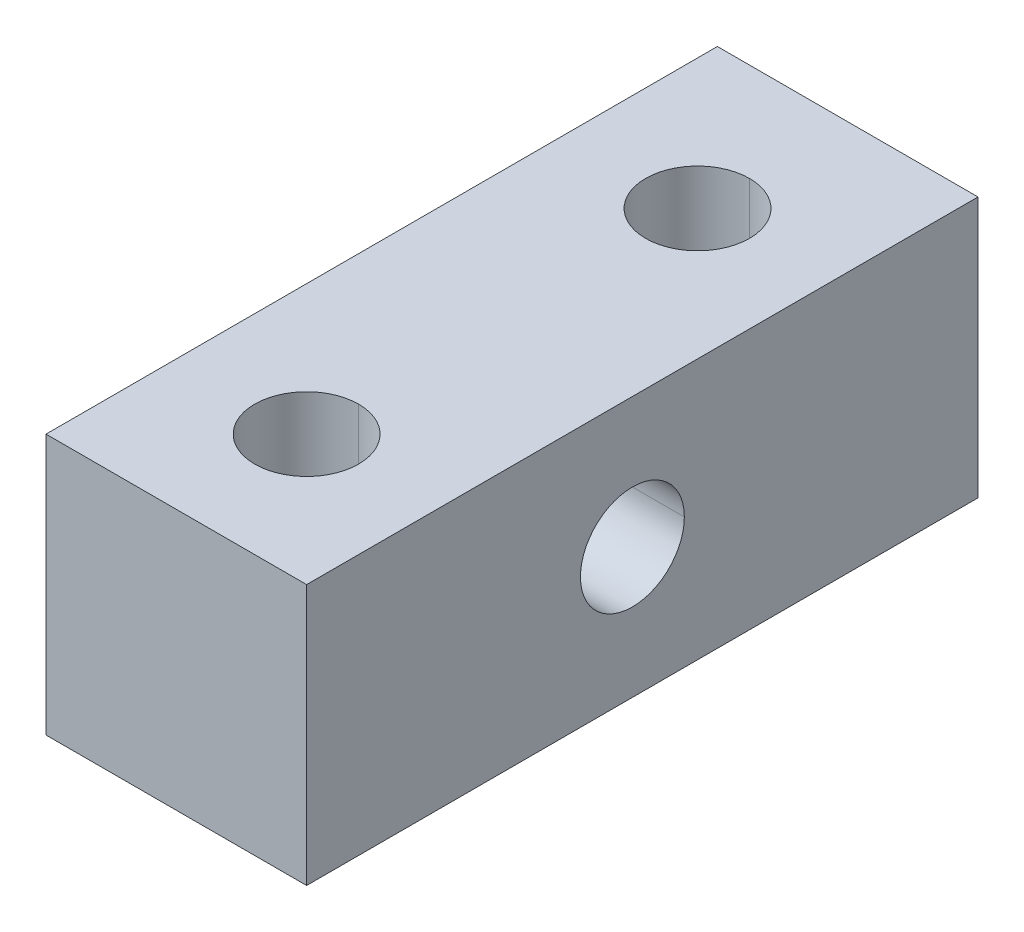
ISO-10303-21;
HEADER;
FILE_DESCRIPTION(('STEP AP214'),'2;1');
FILE_NAME('part.step','',(''),(''),'','','');
FILE_SCHEMA(('AUTOMOTIVE_DESIGN { 1 0 10303 214 1 1 1 1 }'));
ENDSEC;
DATA;
#1=APPLICATION_CONTEXT('core data for automotive mechanical design processes');
#2=APPLICATION_PROTOCOL_DEFINITION('international standard','automotive_design',2000,#1);
#3=PRODUCT_CONTEXT('',#1,'mechanical');
#4=PRODUCT('Part','Part','',(#3));
#5=PRODUCT_RELATED_PRODUCT_CATEGORY('part','',(#4));
#6=PRODUCT_DEFINITION_FORMATION('','',#4);
#7=PRODUCT_DEFINITION_CONTEXT('part definition',#1,'design');
#8=PRODUCT_DEFINITION('design','',#6,#7);
#9=PRODUCT_DEFINITION_SHAPE('','',#8);
#10=(LENGTH_UNIT() NAMED_UNIT(*) SI_UNIT(.MILLI.,.METRE.));
#11=(NAMED_UNIT(*) PLANE_ANGLE_UNIT() SI_UNIT($,.RADIAN.));
#12=(NAMED_UNIT(*) SI_UNIT($,.STERADIAN.) SOLID_ANGLE_UNIT());
#13=UNCERTAINTY_MEASURE_WITH_UNIT(LENGTH_MEASURE(1.E-05),#10,'distance_accuracy_value','');
#14=(GEOMETRIC_REPRESENTATION_CONTEXT(3) GLOBAL_UNCERTAINTY_ASSIGNED_CONTEXT((#13)) GLOBAL_UNIT_ASSIGNED_CONTEXT((#10,
#11,#12)) REPRESENTATION_CONTEXT('',''));
#15=CARTESIAN_POINT('',(0.,0.,0.));
#16=DIRECTION('',(0.,0.,1.));
#17=DIRECTION('',(1.,0.,0.));
#18=AXIS2_PLACEMENT_3D('',#15,#16,#17);
#19=CARTESIAN_POINT('',(4.7625,0.,-11.90625));
#20=DIRECTION('',(1.,0.,0.));
#21=DIRECTION('',(0.,0.,-1.));
#22=AXIS2_PLACEMENT_3D('',#19,#20,#21);
#23=CYLINDRICAL_SURFACE('',#22,1.89865);
#24=DIRECTION('',(1.,0.,0.));
#25=VECTOR('',#24,1.);
#26=CARTESIAN_POINT('',(4.7625,0.,-10.0076));
#27=LINE('',#26,#25);
#28=CARTESIAN_POINT('',(-4.7625,0.,-10.0076));
#29=VERTEX_POINT('',#28);
#30=CARTESIAN_POINT('',(4.7625,0.,-10.0076));
#31=VERTEX_POINT('',#30);
#32=EDGE_CURVE('E132',#29,#31,#27,.T.);
#33=ORIENTED_EDGE('',*,*,#32,.F.);
#34=CARTESIAN_POINT('',(-4.7625,0.,-11.90625));
#35=DIRECTION('',(1.,0.,0.));
#36=DIRECTION('',(0.,0.,-1.));
#37=AXIS2_PLACEMENT_3D('',#34,#35,#36);
#38=CIRCLE('',#37,1.89865);
#39=CARTESIAN_POINT('',(-4.7625,0.,-13.8049));
#40=VERTEX_POINT('',#39);
#41=EDGE_CURVE('E61',#40,#29,#38,.T.);
#42=ORIENTED_EDGE('',*,*,#41,.F.);
#43=DIRECTION('',(1.,0.,0.));
#44=VECTOR('',#43,1.);
#45=CARTESIAN_POINT('',(4.7625,0.,-13.8049));
#46=LINE('',#45,#44);
#47=CARTESIAN_POINT('',(4.7625,0.,-13.8049));
#48=VERTEX_POINT('',#47);
#49=EDGE_CURVE('E125',#40,#48,#46,.T.);
#50=ORIENTED_EDGE('',*,*,#49,.T.);
#51=CARTESIAN_POINT('',(4.7625,0.,-11.90625));
#52=DIRECTION('',(1.,0.,0.));
#53=DIRECTION('',(0.,0.,-1.));
#54=AXIS2_PLACEMENT_3D('',#51,#52,#53);
#55=CIRCLE('',#54,1.89865);
#56=EDGE_CURVE('E115',#48,#31,#55,.T.);
#57=ORIENTED_EDGE('',*,*,#56,.T.);
#58=EDGE_LOOP('',(#33,#42,#50,#57));
#59=FACE_BOUND('',#58,.T.);
#60=ADVANCED_FACE('F15',(#59),#23,.F.);
#61=CARTESIAN_POINT('',(0.,4.7625,-4.7625));
#62=DIRECTION('',(0.,1.,0.));
#63=DIRECTION('',(0.,0.,1.));
#64=AXIS2_PLACEMENT_3D('',#61,#62,#63);
#65=CYLINDRICAL_SURFACE('',#64,1.89865);
#66=DIRECTION('',(0.,1.,0.));
#67=VECTOR('',#66,1.);
#68=CARTESIAN_POINT('',(0.,4.7625,-6.66115));
#69=LINE('',#68,#67);
#70=CARTESIAN_POINT('',(0.,-4.7625,-6.66115));
#71=VERTEX_POINT('',#70);
#72=CARTESIAN_POINT('',(0.,4.7625,-6.66115));
#73=VERTEX_POINT('',#72);
#74=EDGE_CURVE('E19',#71,#73,#69,.T.);
#75=ORIENTED_EDGE('',*,*,#74,.F.);
#76=CARTESIAN_POINT('',(0.,-4.7625,-4.7625));
#77=DIRECTION('',(0.,1.,0.));
#78=DIRECTION('',(0.,0.,1.));
#79=AXIS2_PLACEMENT_3D('',#76,#77,#78);
#80=CIRCLE('',#79,1.89865);
#81=CARTESIAN_POINT('',(0.,-4.7625,-2.86385));
#82=VERTEX_POINT('',#81);
#83=EDGE_CURVE('E26',#82,#71,#80,.T.);
#84=ORIENTED_EDGE('',*,*,#83,.F.);
#85=DIRECTION('',(0.,1.,0.));
#86=VECTOR('',#85,1.);
#87=CARTESIAN_POINT('',(0.,4.7625,-2.86385));
#88=LINE('',#87,#86);
#89=CARTESIAN_POINT('',(0.,4.7625,-2.86385));
#90=VERTEX_POINT('',#89);
#91=EDGE_CURVE('E159',#82,#90,#88,.T.);
#92=ORIENTED_EDGE('',*,*,#91,.T.);
#93=CARTESIAN_POINT('',(0.,4.7625,-4.7625));
#94=DIRECTION('',(0.,1.,0.));
#95=DIRECTION('',(0.,0.,1.));
#96=AXIS2_PLACEMENT_3D('',#93,#94,#95);
#97=CIRCLE('',#96,1.89865);
#98=EDGE_CURVE('E195',#90,#73,#97,.T.);
#99=ORIENTED_EDGE('',*,*,#98,.T.);
#100=EDGE_LOOP('',(#75,#84,#92,#99));
#101=FACE_BOUND('',#100,.T.);
#102=ADVANCED_FACE('F267',(#101),#65,.F.);
#103=CARTESIAN_POINT('',(0.,4.7625,-19.05));
#104=DIRECTION('',(0.,1.,0.));
#105=DIRECTION('',(0.,0.,1.));
#106=AXIS2_PLACEMENT_3D('',#103,#104,#105);
#107=CYLINDRICAL_SURFACE('',#106,1.89865);
#108=DIRECTION('',(0.,1.,0.));
#109=VECTOR('',#108,1.);
#110=CARTESIAN_POINT('',(0.,4.7625,-20.94865));
#111=LINE('',#110,#109);
#112=CARTESIAN_POINT('',(0.,-4.7625,-20.94865));
#113=VERTEX_POINT('',#112);
#114=CARTESIAN_POINT('',(0.,4.7625,-20.94865));
#115=VERTEX_POINT('',#114);
#116=EDGE_CURVE('E168',#113,#115,#111,.T.);
#117=ORIENTED_EDGE('',*,*,#116,.F.);
#118=CARTESIAN_POINT('',(0.,-4.7625,-19.05));
#119=DIRECTION('',(0.,1.,0.));
#120=DIRECTION('',(0.,0.,1.));
#121=AXIS2_PLACEMENT_3D('',#118,#119,#120);
#122=CIRCLE('',#121,1.89865);
#123=CARTESIAN_POINT('',(0.,-4.7625,-17.15135));
#124=VERTEX_POINT('',#123);
#125=EDGE_CURVE('E10',#124,#113,#122,.T.);
#126=ORIENTED_EDGE('',*,*,#125,.F.);
#127=DIRECTION('',(0.,1.,0.));
#128=VECTOR('',#127,1.);
#129=CARTESIAN_POINT('',(0.,4.7625,-17.15135));
#130=LINE('',#129,#128);
#131=CARTESIAN_POINT('',(0.,4.7625,-17.15135));
#132=VERTEX_POINT('',#131);
#133=EDGE_CURVE('E199',#124,#132,#130,.T.);
#134=ORIENTED_EDGE('',*,*,#133,.T.);
#135=CARTESIAN_POINT('',(0.,4.7625,-19.05));
#136=DIRECTION('',(0.,1.,0.));
#137=DIRECTION('',(0.,0.,1.));
#138=AXIS2_PLACEMENT_3D('',#135,#136,#137);
#139=CIRCLE('',#138,1.89865);
#140=EDGE_CURVE('E174',#132,#115,#139,.T.);
#141=ORIENTED_EDGE('',*,*,#140,.T.);
#142=EDGE_LOOP('',(#117,#126,#134,#141));
#143=FACE_BOUND('',#142,.T.);
#144=ADVANCED_FACE('F222',(#143),#107,.F.);
#145=CARTESIAN_POINT('',(-4.7625,4.7625,0.));
#146=DIRECTION('',(0.,0.,1.));
#147=DIRECTION('',(1.,0.,0.));
#148=AXIS2_PLACEMENT_3D('',#145,#146,#147);
#149=PLANE('',#148);
#150=DIRECTION('',(0.,-1.,0.));
#151=VECTOR('',#150,1.);
#152=CARTESIAN_POINT('',(-4.7625,-4.7625,0.));
#153=LINE('',#152,#151);
#154=CARTESIAN_POINT('',(-4.7625,4.7625,0.));
#155=VERTEX_POINT('',#154);
#156=CARTESIAN_POINT('',(-4.7625,-4.7625,0.));
#157=VERTEX_POINT('',#156);
#158=EDGE_CURVE('E178',#155,#157,#153,.T.);
#159=ORIENTED_EDGE('',*,*,#158,.T.);
#160=DIRECTION('',(1.,0.,0.));
#161=VECTOR('',#160,1.);
#162=CARTESIAN_POINT('',(4.7625,-4.7625,0.));
#163=LINE('',#162,#161);
#164=CARTESIAN_POINT('',(4.7625,-4.7625,0.));
#165=VERTEX_POINT('',#164);
#166=EDGE_CURVE('E122',#157,#165,#163,.T.);
#167=ORIENTED_EDGE('',*,*,#166,.T.);
#168=DIRECTION('',(0.,1.,0.));
#169=VECTOR('',#168,1.);
#170=CARTESIAN_POINT('',(4.7625,-4.7625,0.));
#171=LINE('',#170,#169);
#172=CARTESIAN_POINT('',(4.7625,4.7625,0.));
#173=VERTEX_POINT('',#172);
#174=EDGE_CURVE('E169',#165,#173,#171,.T.);
#175=ORIENTED_EDGE('',*,*,#174,.T.);
#176=DIRECTION('',(-1.,0.,0.));
#177=VECTOR('',#176,1.);
#178=CARTESIAN_POINT('',(4.7625,4.7625,0.));
#179=LINE('',#178,#177);
#180=EDGE_CURVE('E145',#173,#155,#179,.T.);
#181=ORIENTED_EDGE('',*,*,#180,.T.);
#182=EDGE_LOOP('',(#159,#167,#175,#181));
#183=FACE_BOUND('',#182,.T.);
#184=ADVANCED_FACE('F238',(#183),#149,.T.);
#185=CARTESIAN_POINT('',(-4.7625,4.7625,-24.5374922));
#186=DIRECTION('',(0.,0.,1.));
#187=DIRECTION('',(1.,0.,0.));
#188=AXIS2_PLACEMENT_3D('',#185,#186,#187);
#189=PLANE('',#188);
#190=DIRECTION('',(0.,-1.,0.));
#191=VECTOR('',#190,1.);
#192=CARTESIAN_POINT('',(-4.7625,-4.7625,-24.5374922));
#193=LINE('',#192,#191);
#194=CARTESIAN_POINT('',(-4.7625,4.7625,-24.5374922));
#195=VERTEX_POINT('',#194);
#196=CARTESIAN_POINT('',(-4.7625,-4.7625,-24.5374922));
#197=VERTEX_POINT('',#196);
#198=EDGE_CURVE('E149',#195,#197,#193,.T.);
#199=ORIENTED_EDGE('',*,*,#198,.F.);
#200=DIRECTION('',(-1.,0.,0.));
#201=VECTOR('',#200,1.);
#202=CARTESIAN_POINT('',(4.7625,4.7625,-24.5374922));
#203=LINE('',#202,#201);
#204=CARTESIAN_POINT('',(4.7625,4.7625,-24.5374922));
#205=VERTEX_POINT('',#204);
#206=EDGE_CURVE('E187',#205,#195,#203,.T.);
#207=ORIENTED_EDGE('',*,*,#206,.F.);
#208=DIRECTION('',(0.,1.,0.));
#209=VECTOR('',#208,1.);
#210=CARTESIAN_POINT('',(4.7625,-4.7625,-24.5374922));
#211=LINE('',#210,#209);
#212=CARTESIAN_POINT('',(4.7625,-4.7625,-24.5374922));
#213=VERTEX_POINT('',#212);
#214=EDGE_CURVE('E123',#213,#205,#211,.T.);
#215=ORIENTED_EDGE('',*,*,#214,.F.);
#216=DIRECTION('',(1.,0.,0.));
#217=VECTOR('',#216,1.);
#218=CARTESIAN_POINT('',(4.7625,-4.7625,-24.5374922));
#219=LINE('',#218,#217);
#220=EDGE_CURVE('E41',#197,#213,#219,.T.);
#221=ORIENTED_EDGE('',*,*,#220,.F.);
#222=EDGE_LOOP('',(#199,#207,#215,#221));
#223=FACE_BOUND('',#222,.T.);
#224=ADVANCED_FACE('F226',(#223),#189,.F.);
#225=CARTESIAN_POINT('',(4.7625,-4.7625,-24.5374922));
#226=DIRECTION('',(0.,-1.,0.));
#227=DIRECTION('',(0.,0.,-1.));
#228=AXIS2_PLACEMENT_3D('',#225,#226,#227);
#229=PLANE('',#228);
#230=ORIENTED_EDGE('',*,*,#125,.T.);
#231=CARTESIAN_POINT('',(0.,-4.7625,-19.05));
#232=DIRECTION('',(0.,1.,0.));
#233=DIRECTION('',(0.,0.,1.));
#234=AXIS2_PLACEMENT_3D('',#231,#232,#233);
#235=CIRCLE('',#234,1.89865);
#236=EDGE_CURVE('E163',#113,#124,#235,.T.);
#237=ORIENTED_EDGE('',*,*,#236,.T.);
#238=EDGE_LOOP('',(#230,#237));
#239=FACE_BOUND('',#238,.T.);
#240=ORIENTED_EDGE('',*,*,#83,.T.);
#241=CARTESIAN_POINT('',(0.,-4.7625,-4.7625));
#242=DIRECTION('',(0.,1.,0.));
#243=DIRECTION('',(0.,0.,1.));
#244=AXIS2_PLACEMENT_3D('',#241,#242,#243);
#245=CIRCLE('',#244,1.89865);
#246=EDGE_CURVE('E129',#71,#82,#245,.T.);
#247=ORIENTED_EDGE('',*,*,#246,.T.);
#248=EDGE_LOOP('',(#240,#247));
#249=FACE_BOUND('',#248,.T.);
#250=ORIENTED_EDGE('',*,*,#166,.F.);
#251=DIRECTION('',(0.,0.,1.));
#252=VECTOR('',#251,1.);
#253=CARTESIAN_POINT('',(-4.7625,-4.7625,-24.5374922));
#254=LINE('',#253,#252);
#255=EDGE_CURVE('E146',#197,#157,#254,.T.);
#256=ORIENTED_EDGE('',*,*,#255,.F.);
#257=ORIENTED_EDGE('',*,*,#220,.T.);
#258=DIRECTION('',(0.,0.,1.));
#259=VECTOR('',#258,1.);
#260=CARTESIAN_POINT('',(4.7625,-4.7625,-24.5374922));
#261=LINE('',#260,#259);
#262=EDGE_CURVE('E173',#213,#165,#261,.T.);
#263=ORIENTED_EDGE('',*,*,#262,.T.);
#264=EDGE_LOOP('',(#250,#256,#257,#263));
#265=FACE_BOUND('',#264,.T.);
#266=ADVANCED_FACE('F17',(#239,#249,#265),#229,.T.);
#267=CARTESIAN_POINT('',(4.7625,-4.7625,-24.5374922));
#268=DIRECTION('',(1.,0.,0.));
#269=DIRECTION('',(0.,1.,0.));
#270=AXIS2_PLACEMENT_3D('',#267,#268,#269);
#271=PLANE('',#270);
#272=ORIENTED_EDGE('',*,*,#56,.F.);
#273=CARTESIAN_POINT('',(4.7625,0.,-11.90625));
#274=DIRECTION('',(1.,0.,0.));
#275=DIRECTION('',(0.,0.,-1.));
#276=AXIS2_PLACEMENT_3D('',#273,#274,#275);
#277=CIRCLE('',#276,1.89865);
#278=EDGE_CURVE('E119',#31,#48,#277,.T.);
#279=ORIENTED_EDGE('',*,*,#278,.F.);
#280=EDGE_LOOP('',(#272,#279));
#281=FACE_BOUND('',#280,.T.);
#282=ORIENTED_EDGE('',*,*,#174,.F.);
#283=ORIENTED_EDGE('',*,*,#262,.F.);
#284=ORIENTED_EDGE('',*,*,#214,.T.);
#285=DIRECTION('',(0.,0.,1.));
#286=VECTOR('',#285,1.);
#287=CARTESIAN_POINT('',(4.7625,4.7625,-24.5374922));
#288=LINE('',#287,#286);
#289=EDGE_CURVE('E184',#205,#173,#288,.T.);
#290=ORIENTED_EDGE('',*,*,#289,.T.);
#291=EDGE_LOOP('',(#282,#283,#284,#290));
#292=FACE_BOUND('',#291,.T.);
#293=ADVANCED_FACE('F116',(#281,#292),#271,.T.);
#294=CARTESIAN_POINT('',(4.7625,4.7625,-24.5374922));
#295=DIRECTION('',(0.,1.,0.));
#296=DIRECTION('',(1.,0.,0.));
#297=AXIS2_PLACEMENT_3D('',#294,#295,#296);
#298=PLANE('',#297);
#299=ORIENTED_EDGE('',*,*,#140,.F.);
#300=CARTESIAN_POINT('',(0.,4.7625,-19.05));
#301=DIRECTION('',(0.,1.,0.));
#302=DIRECTION('',(0.,0.,1.));
#303=AXIS2_PLACEMENT_3D('',#300,#301,#302);
#304=CIRCLE('',#303,1.89865);
#305=EDGE_CURVE('E192',#115,#132,#304,.T.);
#306=ORIENTED_EDGE('',*,*,#305,.F.);
#307=EDGE_LOOP('',(#299,#306));
#308=FACE_BOUND('',#307,.T.);
#309=ORIENTED_EDGE('',*,*,#98,.F.);
#310=CARTESIAN_POINT('',(0.,4.7625,-4.7625));
#311=DIRECTION('',(0.,1.,0.));
#312=DIRECTION('',(0.,0.,1.));
#313=AXIS2_PLACEMENT_3D('',#310,#311,#312);
#314=CIRCLE('',#313,1.89865);
#315=EDGE_CURVE('E164',#73,#90,#314,.T.);
#316=ORIENTED_EDGE('',*,*,#315,.F.);
#317=EDGE_LOOP('',(#309,#316));
#318=FACE_BOUND('',#317,.T.);
#319=ORIENTED_EDGE('',*,*,#180,.F.);
#320=ORIENTED_EDGE('',*,*,#289,.F.);
#321=ORIENTED_EDGE('',*,*,#206,.T.);
#322=DIRECTION('',(0.,0.,1.));
#323=VECTOR('',#322,1.);
#324=CARTESIAN_POINT('',(-4.7625,4.7625,-24.5374922));
#325=LINE('',#324,#323);
#326=EDGE_CURVE('E153',#195,#155,#325,.T.);
#327=ORIENTED_EDGE('',*,*,#326,.T.);
#328=EDGE_LOOP('',(#319,#320,#321,#327));
#329=FACE_BOUND('',#328,.T.);
#330=ADVANCED_FACE('F218',(#308,#318,#329),#298,.T.);
#331=CARTESIAN_POINT('',(-4.7625,-4.7625,-24.5374922));
#332=DIRECTION('',(-1.,0.,0.));
#333=DIRECTION('',(0.,0.,1.));
#334=AXIS2_PLACEMENT_3D('',#331,#332,#333);
#335=PLANE('',#334);
#336=ORIENTED_EDGE('',*,*,#41,.T.);
#337=CARTESIAN_POINT('',(-4.7625,0.,-11.90625));
#338=DIRECTION('',(1.,0.,0.));
#339=DIRECTION('',(0.,0.,-1.));
#340=AXIS2_PLACEMENT_3D('',#337,#338,#339);
#341=CIRCLE('',#340,1.89865);
#342=EDGE_CURVE('E139',#29,#40,#341,.T.);
#343=ORIENTED_EDGE('',*,*,#342,.T.);
#344=EDGE_LOOP('',(#336,#343));
#345=FACE_BOUND('',#344,.T.);
#346=ORIENTED_EDGE('',*,*,#158,.F.);
#347=ORIENTED_EDGE('',*,*,#326,.F.);
#348=ORIENTED_EDGE('',*,*,#198,.T.);
#349=ORIENTED_EDGE('',*,*,#255,.T.);
#350=EDGE_LOOP('',(#346,#347,#348,#349));
#351=FACE_BOUND('',#350,.T.);
#352=ADVANCED_FACE('F234',(#345,#351),#335,.T.);
#353=CARTESIAN_POINT('',(0.,4.7625,-19.05));
#354=DIRECTION('',(0.,1.,0.));
#355=DIRECTION('',(0.,0.,1.));
#356=AXIS2_PLACEMENT_3D('',#353,#354,#355);
#357=CYLINDRICAL_SURFACE('',#356,1.89865);
#358=ORIENTED_EDGE('',*,*,#236,.F.);
#359=ORIENTED_EDGE('',*,*,#116,.T.);
#360=ORIENTED_EDGE('',*,*,#305,.T.);
#361=ORIENTED_EDGE('',*,*,#133,.F.);
#362=EDGE_LOOP('',(#358,#359,#360,#361));
#363=FACE_BOUND('',#362,.T.);
#364=ADVANCED_FACE('F213',(#363),#357,.F.);
#365=CARTESIAN_POINT('',(0.,4.7625,-4.7625));
#366=DIRECTION('',(0.,1.,0.));
#367=DIRECTION('',(0.,0.,1.));
#368=AXIS2_PLACEMENT_3D('',#365,#366,#367);
#369=CYLINDRICAL_SURFACE('',#368,1.89865);
#370=ORIENTED_EDGE('',*,*,#246,.F.);
#371=ORIENTED_EDGE('',*,*,#74,.T.);
#372=ORIENTED_EDGE('',*,*,#315,.T.);
#373=ORIENTED_EDGE('',*,*,#91,.F.);
#374=EDGE_LOOP('',(#370,#371,#372,#373));
#375=FACE_BOUND('',#374,.T.);
#376=ADVANCED_FACE('F261',(#375),#369,.F.);
#377=CARTESIAN_POINT('',(4.7625,0.,-11.90625));
#378=DIRECTION('',(1.,0.,0.));
#379=DIRECTION('',(0.,0.,-1.));
#380=AXIS2_PLACEMENT_3D('',#377,#378,#379);
#381=CYLINDRICAL_SURFACE('',#380,1.89865);
#382=ORIENTED_EDGE('',*,*,#342,.F.);
#383=ORIENTED_EDGE('',*,*,#32,.T.);
#384=ORIENTED_EDGE('',*,*,#278,.T.);
#385=ORIENTED_EDGE('',*,*,#49,.F.);
#386=EDGE_LOOP('',(#382,#383,#384,#385));
#387=FACE_BOUND('',#386,.T.);
#388=ADVANCED_FACE('F131',(#387),#381,.F.);
#389=CLOSED_SHELL('',(#60,#102,#144,#184,#224,#266,#293,#330,#352,#364,#376,#388));
#390=MANIFOLD_SOLID_BREP('B1',#389);
#391=ADVANCED_BREP_SHAPE_REPRESENTATION('',(#18,#390),#14);
#392=SHAPE_DEFINITION_REPRESENTATION(#9,#391);
ENDSEC;
END-ISO-10303-21;
